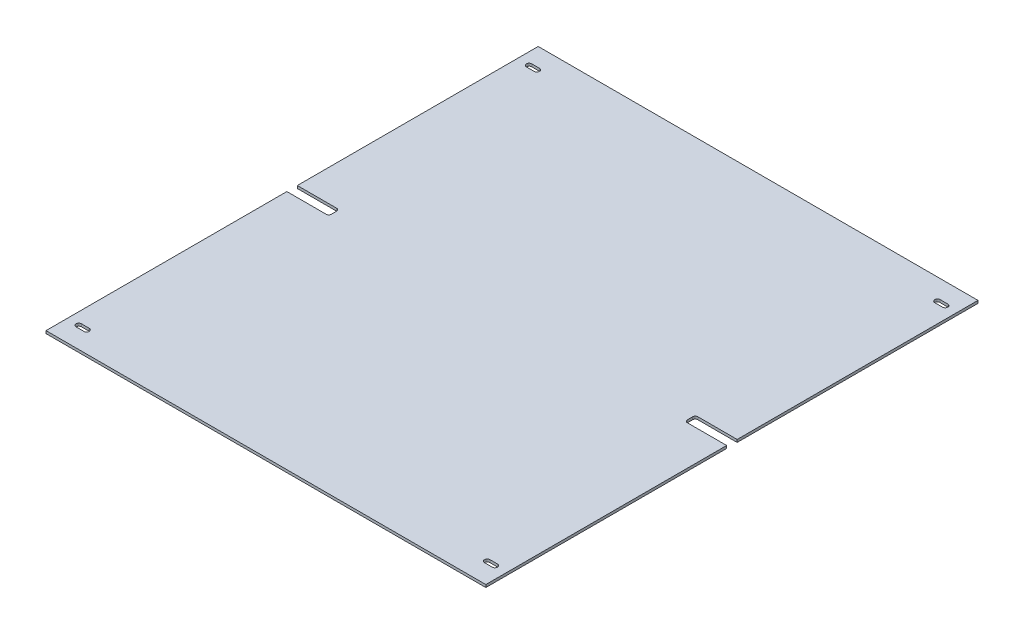
ISO-10303-21;
HEADER;
FILE_DESCRIPTION(('STEP AP214'),'2;1');
FILE_NAME('part.step','',(''),(''),'','','');
FILE_SCHEMA(('AUTOMOTIVE_DESIGN { 1 0 10303 214 1 1 1 1 }'));
ENDSEC;
DATA;
#1=APPLICATION_CONTEXT('core data for automotive mechanical design processes');
#2=APPLICATION_PROTOCOL_DEFINITION('international standard','automotive_design',2000,#1);
#3=PRODUCT_CONTEXT('',#1,'mechanical');
#4=PRODUCT('Part','Part','',(#3));
#5=PRODUCT_RELATED_PRODUCT_CATEGORY('part','',(#4));
#6=PRODUCT_DEFINITION_FORMATION('','',#4);
#7=PRODUCT_DEFINITION_CONTEXT('part definition',#1,'design');
#8=PRODUCT_DEFINITION('design','',#6,#7);
#9=PRODUCT_DEFINITION_SHAPE('','',#8);
#10=(LENGTH_UNIT() NAMED_UNIT(*) SI_UNIT(.MILLI.,.METRE.));
#11=(NAMED_UNIT(*) PLANE_ANGLE_UNIT() SI_UNIT($,.RADIAN.));
#12=(NAMED_UNIT(*) SI_UNIT($,.STERADIAN.) SOLID_ANGLE_UNIT());
#13=UNCERTAINTY_MEASURE_WITH_UNIT(LENGTH_MEASURE(1.E-05),#10,'distance_accuracy_value','');
#14=(GEOMETRIC_REPRESENTATION_CONTEXT(3) GLOBAL_UNCERTAINTY_ASSIGNED_CONTEXT((#13)) GLOBAL_UNIT_ASSIGNED_CONTEXT((#10,
#11,#12)) REPRESENTATION_CONTEXT('',''));
#15=CARTESIAN_POINT('',(0.,0.,0.));
#16=DIRECTION('',(0.,0.,1.));
#17=DIRECTION('',(1.,0.,0.));
#18=AXIS2_PLACEMENT_3D('',#15,#16,#17);
#19=CARTESIAN_POINT('',(266.7,3.175,298.45));
#20=DIRECTION('',(-1.,0.,0.));
#21=DIRECTION('',(0.,0.,1.));
#22=AXIS2_PLACEMENT_3D('',#19,#20,#21);
#23=PLANE('',#22);
#24=DIRECTION('',(0.,0.,-1.));
#25=VECTOR('',#24,1.);
#26=CARTESIAN_POINT('',(266.7,0.,298.45));
#27=LINE('',#26,#25);
#28=CARTESIAN_POINT('',(266.7,0.,298.45));
#29=VERTEX_POINT('',#28);
#30=CARTESIAN_POINT('',(266.7,0.,6.34999999999997));
#31=VERTEX_POINT('',#30);
#32=EDGE_CURVE('E772',#29,#31,#27,.T.);
#33=ORIENTED_EDGE('',*,*,#32,.T.);
#34=DIRECTION('',(0.,1.,0.));
#35=VECTOR('',#34,1.);
#36=CARTESIAN_POINT('',(266.7,0.,6.34999999999997));
#37=LINE('',#36,#35);
#38=CARTESIAN_POINT('',(266.7,3.175,6.34999999999997));
#39=VERTEX_POINT('',#38);
#40=EDGE_CURVE('E583',#31,#39,#37,.T.);
#41=ORIENTED_EDGE('',*,*,#40,.T.);
#42=DIRECTION('',(0.,0.,-1.));
#43=VECTOR('',#42,1.);
#44=CARTESIAN_POINT('',(266.7,3.175,298.45));
#45=LINE('',#44,#43);
#46=CARTESIAN_POINT('',(266.7,3.175,298.45));
#47=VERTEX_POINT('',#46);
#48=EDGE_CURVE('E759',#47,#39,#45,.T.);
#49=ORIENTED_EDGE('',*,*,#48,.F.);
#50=DIRECTION('',(0.,-1.,0.));
#51=VECTOR('',#50,1.);
#52=CARTESIAN_POINT('',(266.7,3.175,298.45));
#53=LINE('',#52,#51);
#54=EDGE_CURVE('E771',#47,#29,#53,.T.);
#55=ORIENTED_EDGE('',*,*,#54,.T.);
#56=EDGE_LOOP('',(#33,#41,#49,#55));
#57=FACE_BOUND('',#56,.T.);
#58=ADVANCED_FACE('F331',(#57),#23,.F.);
#59=CARTESIAN_POINT('',(-266.7,3.175,298.45));
#60=DIRECTION('',(1.,0.,0.));
#61=DIRECTION('',(0.,0.,-1.));
#62=AXIS2_PLACEMENT_3D('',#59,#60,#61);
#63=PLANE('',#62);
#64=DIRECTION('',(0.,0.,1.));
#65=VECTOR('',#64,1.);
#66=CARTESIAN_POINT('',(-266.7,0.,298.45));
#67=LINE('',#66,#65);
#68=CARTESIAN_POINT('',(-266.7,0.,-298.45));
#69=VERTEX_POINT('',#68);
#70=CARTESIAN_POINT('',(-266.7,0.,-6.34999999999999));
#71=VERTEX_POINT('',#70);
#72=EDGE_CURVE('E778',#69,#71,#67,.T.);
#73=ORIENTED_EDGE('',*,*,#72,.T.);
#74=DIRECTION('',(0.,1.,0.));
#75=VECTOR('',#74,1.);
#76=CARTESIAN_POINT('',(-266.7,0.,-6.34999999999999));
#77=LINE('',#76,#75);
#78=CARTESIAN_POINT('',(-266.7,3.175,-6.34999999999999));
#79=VERTEX_POINT('',#78);
#80=EDGE_CURVE('E607',#71,#79,#77,.T.);
#81=ORIENTED_EDGE('',*,*,#80,.T.);
#82=DIRECTION('',(0.,0.,1.));
#83=VECTOR('',#82,1.);
#84=CARTESIAN_POINT('',(-266.7,3.175,298.45));
#85=LINE('',#84,#83);
#86=CARTESIAN_POINT('',(-266.7,3.175,-298.45));
#87=VERTEX_POINT('',#86);
#88=EDGE_CURVE('E766',#87,#79,#85,.T.);
#89=ORIENTED_EDGE('',*,*,#88,.F.);
#90=DIRECTION('',(0.,-1.,0.));
#91=VECTOR('',#90,1.);
#92=CARTESIAN_POINT('',(-266.7,3.175,-298.45));
#93=LINE('',#92,#91);
#94=EDGE_CURVE('E339',#87,#69,#93,.T.);
#95=ORIENTED_EDGE('',*,*,#94,.T.);
#96=EDGE_LOOP('',(#73,#81,#89,#95));
#97=FACE_BOUND('',#96,.T.);
#98=ADVANCED_FACE('F792',(#97),#63,.F.);
#99=CARTESIAN_POINT('',(0.,3.175,0.));
#100=DIRECTION('',(0.,-1.,0.));
#101=DIRECTION('',(0.,0.,-1.));
#102=AXIS2_PLACEMENT_3D('',#99,#100,#101);
#103=PLANE('',#102);
#104=ORIENTED_EDGE('',*,*,#48,.T.);
#105=DIRECTION('',(1.,0.,0.));
#106=VECTOR('',#105,1.);
#107=CARTESIAN_POINT('',(219.075,3.175,6.34999999999994));
#108=LINE('',#107,#106);
#109=CARTESIAN_POINT('',(219.075,3.175,6.34999999999994));
#110=VERTEX_POINT('',#109);
#111=EDGE_CURVE('E563',#110,#39,#108,.T.);
#112=ORIENTED_EDGE('',*,*,#111,.F.);
#113=CARTESIAN_POINT('',(219.075,3.175,3.17499999999994));
#114=DIRECTION('',(0.,1.,0.));
#115=DIRECTION('',(0.,0.,1.));
#116=AXIS2_PLACEMENT_3D('',#113,#114,#115);
#117=CIRCLE('',#116,3.17500000000001);
#118=CARTESIAN_POINT('',(215.9,3.175,3.17499999999994));
#119=VERTEX_POINT('',#118);
#120=EDGE_CURVE('E565',#119,#110,#117,.T.);
#121=ORIENTED_EDGE('',*,*,#120,.F.);
#122=DIRECTION('',(0.,0.,1.));
#123=VECTOR('',#122,1.);
#124=CARTESIAN_POINT('',(215.9,3.175,-3.17500000000006));
#125=LINE('',#124,#123);
#126=CARTESIAN_POINT('',(215.9,3.175,-3.17500000000006));
#127=VERTEX_POINT('',#126);
#128=EDGE_CURVE('E578',#127,#119,#125,.T.);
#129=ORIENTED_EDGE('',*,*,#128,.F.);
#130=CARTESIAN_POINT('',(219.075,3.175,-3.17500000000006));
#131=DIRECTION('',(0.,1.,0.));
#132=DIRECTION('',(0.,0.,1.));
#133=AXIS2_PLACEMENT_3D('',#130,#131,#132);
#134=CIRCLE('',#133,3.17500000000001);
#135=CARTESIAN_POINT('',(219.075,3.175,-6.35000000000006));
#136=VERTEX_POINT('',#135);
#137=EDGE_CURVE('E575',#136,#127,#134,.T.);
#138=ORIENTED_EDGE('',*,*,#137,.F.);
#139=DIRECTION('',(-1.,0.,0.));
#140=VECTOR('',#139,1.);
#141=CARTESIAN_POINT('',(219.075,3.175,-6.35000000000006));
#142=LINE('',#141,#140);
#143=CARTESIAN_POINT('',(266.7,3.175,-6.35000000000005));
#144=VERTEX_POINT('',#143);
#145=EDGE_CURVE('E542',#144,#136,#142,.T.);
#146=ORIENTED_EDGE('',*,*,#145,.F.);
#147=CARTESIAN_POINT('',(266.7,3.175,-298.45));
#148=VERTEX_POINT('',#147);
#149=EDGE_CURVE('E763',#144,#148,#45,.T.);
#150=ORIENTED_EDGE('',*,*,#149,.T.);
#151=DIRECTION('',(-1.,0.,0.));
#152=VECTOR('',#151,1.);
#153=CARTESIAN_POINT('',(-266.7,3.175,-298.45));
#154=LINE('',#153,#152);
#155=EDGE_CURVE('E762',#148,#87,#154,.T.);
#156=ORIENTED_EDGE('',*,*,#155,.T.);
#157=ORIENTED_EDGE('',*,*,#88,.T.);
#158=DIRECTION('',(-1.,0.,0.));
#159=VECTOR('',#158,1.);
#160=CARTESIAN_POINT('',(-219.075,3.175,-6.35));
#161=LINE('',#160,#159);
#162=CARTESIAN_POINT('',(-219.075,3.175,-6.35000000000001));
#163=VERTEX_POINT('',#162);
#164=EDGE_CURVE('E608',#163,#79,#161,.T.);
#165=ORIENTED_EDGE('',*,*,#164,.F.);
#166=CARTESIAN_POINT('',(-219.075,3.175,-3.175));
#167=DIRECTION('',(0.,1.,0.));
#168=DIRECTION('',(0.,0.,-1.));
#169=AXIS2_PLACEMENT_3D('',#166,#167,#168);
#170=CIRCLE('',#169,3.17500000000001);
#171=CARTESIAN_POINT('',(-215.9,3.175,-3.175));
#172=VERTEX_POINT('',#171);
#173=EDGE_CURVE('E596',#172,#163,#170,.T.);
#174=ORIENTED_EDGE('',*,*,#173,.F.);
#175=DIRECTION('',(0.,0.,-1.));
#176=VECTOR('',#175,1.);
#177=CARTESIAN_POINT('',(-215.9,3.175,-3.175));
#178=LINE('',#177,#176);
#179=CARTESIAN_POINT('',(-215.9,3.175,3.175));
#180=VERTEX_POINT('',#179);
#181=EDGE_CURVE('E616',#180,#172,#178,.T.);
#182=ORIENTED_EDGE('',*,*,#181,.F.);
#183=CARTESIAN_POINT('',(-219.075,3.175,3.175));
#184=DIRECTION('',(0.,1.,0.));
#185=DIRECTION('',(0.,0.,-1.));
#186=AXIS2_PLACEMENT_3D('',#183,#184,#185);
#187=CIRCLE('',#186,3.17500000000001);
#188=CARTESIAN_POINT('',(-219.075,3.175,6.35));
#189=VERTEX_POINT('',#188);
#190=EDGE_CURVE('E613',#189,#180,#187,.T.);
#191=ORIENTED_EDGE('',*,*,#190,.F.);
#192=DIRECTION('',(1.,0.,0.));
#193=VECTOR('',#192,1.);
#194=CARTESIAN_POINT('',(-219.075,3.175,6.35));
#195=LINE('',#194,#193);
#196=CARTESIAN_POINT('',(-266.7,3.175,6.35000000000003));
#197=VERTEX_POINT('',#196);
#198=EDGE_CURVE('E610',#197,#189,#195,.T.);
#199=ORIENTED_EDGE('',*,*,#198,.F.);
#200=CARTESIAN_POINT('',(-266.7,3.175,298.45));
#201=VERTEX_POINT('',#200);
#202=EDGE_CURVE('E765',#197,#201,#85,.T.);
#203=ORIENTED_EDGE('',*,*,#202,.T.);
#204=DIRECTION('',(1.,0.,0.));
#205=VECTOR('',#204,1.);
#206=CARTESIAN_POINT('',(-266.7,3.175,298.45));
#207=LINE('',#206,#205);
#208=EDGE_CURVE('E769',#201,#47,#207,.T.);
#209=ORIENTED_EDGE('',*,*,#208,.T.);
#210=EDGE_LOOP('',(#104,#112,#121,#129,#138,#146,#150,#156,#157,#165,#174,#182,#191,#199,#203,#209));
#211=FACE_BOUND('',#210,.T.);
#212=CARTESIAN_POINT('',(252.3236,3.175,273.05));
#213=DIRECTION('',(0.,1.,0.));
#214=DIRECTION('',(0.,0.,1.));
#215=AXIS2_PLACEMENT_3D('',#212,#213,#214);
#216=CIRCLE('',#215,3.26389999999999);
#217=CARTESIAN_POINT('',(252.3236,3.175,276.3139));
#218=VERTEX_POINT('',#217);
#219=CARTESIAN_POINT('',(252.3236,3.175,269.7861));
#220=VERTEX_POINT('',#219);
#221=EDGE_CURVE('E748',#218,#220,#216,.T.);
#222=ORIENTED_EDGE('',*,*,#221,.F.);
#223=DIRECTION('',(1.,0.,0.));
#224=VECTOR('',#223,1.);
#225=CARTESIAN_POINT('',(242.9764,3.175,276.3139));
#226=LINE('',#225,#224);
#227=CARTESIAN_POINT('',(242.9764,3.175,276.3139));
#228=VERTEX_POINT('',#227);
#229=EDGE_CURVE('E727',#228,#218,#226,.T.);
#230=ORIENTED_EDGE('',*,*,#229,.F.);
#231=CARTESIAN_POINT('',(242.9764,3.175,273.05));
#232=DIRECTION('',(0.,1.,0.));
#233=DIRECTION('',(0.,0.,1.));
#234=AXIS2_PLACEMENT_3D('',#231,#232,#233);
#235=CIRCLE('',#234,3.26389999999999);
#236=CARTESIAN_POINT('',(242.9764,3.175,269.7861));
#237=VERTEX_POINT('',#236);
#238=EDGE_CURVE('E737',#237,#228,#235,.T.);
#239=ORIENTED_EDGE('',*,*,#238,.F.);
#240=DIRECTION('',(1.,0.,0.));
#241=VECTOR('',#240,1.);
#242=CARTESIAN_POINT('',(242.9764,3.175,269.7861));
#243=LINE('',#242,#241);
#244=EDGE_CURVE('E734',#237,#220,#243,.T.);
#245=ORIENTED_EDGE('',*,*,#244,.T.);
#246=EDGE_LOOP('',(#222,#230,#239,#245));
#247=FACE_BOUND('',#246,.T.);
#248=DIRECTION('',(1.,0.,0.));
#249=VECTOR('',#248,1.);
#250=CARTESIAN_POINT('',(242.9764,3.175,-276.3139));
#251=LINE('',#250,#249);
#252=CARTESIAN_POINT('',(242.9764,3.175,-276.3139));
#253=VERTEX_POINT('',#252);
#254=CARTESIAN_POINT('',(252.3236,3.175,-276.3139));
#255=VERTEX_POINT('',#254);
#256=EDGE_CURVE('E702',#253,#255,#251,.T.);
#257=ORIENTED_EDGE('',*,*,#256,.T.);
#258=CARTESIAN_POINT('',(252.3236,3.175,-273.05));
#259=DIRECTION('',(0.,1.,0.));
#260=DIRECTION('',(0.,0.,1.));
#261=AXIS2_PLACEMENT_3D('',#258,#259,#260);
#262=CIRCLE('',#261,3.26390000000001);
#263=CARTESIAN_POINT('',(252.3236,3.175,-269.7861));
#264=VERTEX_POINT('',#263);
#265=EDGE_CURVE('E716',#264,#255,#262,.T.);
#266=ORIENTED_EDGE('',*,*,#265,.F.);
#267=DIRECTION('',(1.,0.,0.));
#268=VECTOR('',#267,1.);
#269=CARTESIAN_POINT('',(242.9764,3.175,-269.7861));
#270=LINE('',#269,#268);
#271=CARTESIAN_POINT('',(242.9764,3.175,-269.7861));
#272=VERTEX_POINT('',#271);
#273=EDGE_CURVE('E695',#272,#264,#270,.T.);
#274=ORIENTED_EDGE('',*,*,#273,.F.);
#275=CARTESIAN_POINT('',(242.9764,3.175,-273.05));
#276=DIRECTION('',(0.,1.,0.));
#277=DIRECTION('',(0.,0.,1.));
#278=AXIS2_PLACEMENT_3D('',#275,#276,#277);
#279=CIRCLE('',#278,3.26390000000001);
#280=EDGE_CURVE('E705',#253,#272,#279,.T.);
#281=ORIENTED_EDGE('',*,*,#280,.F.);
#282=EDGE_LOOP('',(#257,#266,#274,#281));
#283=FACE_BOUND('',#282,.T.);
#284=CARTESIAN_POINT('',(-242.9764,3.175,273.05));
#285=DIRECTION('',(0.,1.,0.));
#286=DIRECTION('',(0.,0.,1.));
#287=AXIS2_PLACEMENT_3D('',#284,#285,#286);
#288=CIRCLE('',#287,3.26389999999999);
#289=CARTESIAN_POINT('',(-242.9764,3.175,276.3139));
#290=VERTEX_POINT('',#289);
#291=CARTESIAN_POINT('',(-242.9764,3.175,269.7861));
#292=VERTEX_POINT('',#291);
#293=EDGE_CURVE('E684',#290,#292,#288,.T.);
#294=ORIENTED_EDGE('',*,*,#293,.F.);
#295=DIRECTION('',(1.,0.,0.));
#296=VECTOR('',#295,1.);
#297=CARTESIAN_POINT('',(-252.3236,3.175,276.3139));
#298=LINE('',#297,#296);
#299=CARTESIAN_POINT('',(-252.3236,3.175,276.3139));
#300=VERTEX_POINT('',#299);
#301=EDGE_CURVE('E663',#300,#290,#298,.T.);
#302=ORIENTED_EDGE('',*,*,#301,.F.);
#303=CARTESIAN_POINT('',(-252.3236,3.175,273.05));
#304=DIRECTION('',(0.,1.,0.));
#305=DIRECTION('',(0.,0.,1.));
#306=AXIS2_PLACEMENT_3D('',#303,#304,#305);
#307=CIRCLE('',#306,3.26389999999999);
#308=CARTESIAN_POINT('',(-252.3236,3.175,269.7861));
#309=VERTEX_POINT('',#308);
#310=EDGE_CURVE('E673',#309,#300,#307,.T.);
#311=ORIENTED_EDGE('',*,*,#310,.F.);
#312=DIRECTION('',(1.,0.,0.));
#313=VECTOR('',#312,1.);
#314=CARTESIAN_POINT('',(-252.3236,3.175,269.7861));
#315=LINE('',#314,#313);
#316=EDGE_CURVE('E670',#309,#292,#315,.T.);
#317=ORIENTED_EDGE('',*,*,#316,.T.);
#318=EDGE_LOOP('',(#294,#302,#311,#317));
#319=FACE_BOUND('',#318,.T.);
#320=DIRECTION('',(1.,0.,0.));
#321=VECTOR('',#320,1.);
#322=CARTESIAN_POINT('',(-252.3236,3.175,-269.7861));
#323=LINE('',#322,#321);
#324=CARTESIAN_POINT('',(-252.3236,3.175,-269.7861));
#325=VERTEX_POINT('',#324);
#326=CARTESIAN_POINT('',(-242.9764,3.175,-269.7861));
#327=VERTEX_POINT('',#326);
#328=EDGE_CURVE('E586',#325,#327,#323,.T.);
#329=ORIENTED_EDGE('',*,*,#328,.F.);
#330=CARTESIAN_POINT('',(-252.3236,3.175,-273.05));
#331=DIRECTION('',(0.,1.,0.));
#332=DIRECTION('',(0.,0.,1.));
#333=AXIS2_PLACEMENT_3D('',#330,#331,#332);
#334=CIRCLE('',#333,3.26389999999999);
#335=CARTESIAN_POINT('',(-252.3236,3.175,-276.3139));
#336=VERTEX_POINT('',#335);
#337=EDGE_CURVE('E641',#336,#325,#334,.T.);
#338=ORIENTED_EDGE('',*,*,#337,.F.);
#339=DIRECTION('',(1.,0.,0.));
#340=VECTOR('',#339,1.);
#341=CARTESIAN_POINT('',(-252.3236,3.175,-276.3139));
#342=LINE('',#341,#340);
#343=CARTESIAN_POINT('',(-242.9764,3.175,-276.3139));
#344=VERTEX_POINT('',#343);
#345=EDGE_CURVE('E638',#336,#344,#342,.T.);
#346=ORIENTED_EDGE('',*,*,#345,.T.);
#347=CARTESIAN_POINT('',(-242.9764,3.175,-273.05));
#348=DIRECTION('',(0.,1.,0.));
#349=DIRECTION('',(0.,0.,1.));
#350=AXIS2_PLACEMENT_3D('',#347,#348,#349);
#351=CIRCLE('',#350,3.26389999999999);
#352=EDGE_CURVE('E652',#327,#344,#351,.T.);
#353=ORIENTED_EDGE('',*,*,#352,.F.);
#354=EDGE_LOOP('',(#329,#338,#346,#353));
#355=FACE_BOUND('',#354,.T.);
#356=ADVANCED_FACE('F801',(#211,#247,#283,#319,#355),#103,.F.);
#357=CARTESIAN_POINT('',(0.,0.,0.));
#358=DIRECTION('',(0.,-1.,0.));
#359=DIRECTION('',(0.,0.,-1.));
#360=AXIS2_PLACEMENT_3D('',#357,#358,#359);
#361=PLANE('',#360);
#362=DIRECTION('',(1.,0.,0.));
#363=VECTOR('',#362,1.);
#364=CARTESIAN_POINT('',(219.075,0.,6.34999999999994));
#365=LINE('',#364,#363);
#366=CARTESIAN_POINT('',(219.075,0.,6.34999999999994));
#367=VERTEX_POINT('',#366);
#368=EDGE_CURVE('E572',#367,#31,#365,.T.);
#369=ORIENTED_EDGE('',*,*,#368,.T.);
#370=ORIENTED_EDGE('',*,*,#32,.F.);
#371=DIRECTION('',(1.,0.,0.));
#372=VECTOR('',#371,1.);
#373=CARTESIAN_POINT('',(-266.7,0.,298.45));
#374=LINE('',#373,#372);
#375=CARTESIAN_POINT('',(-266.7,0.,298.45));
#376=VERTEX_POINT('',#375);
#377=EDGE_CURVE('E781',#376,#29,#374,.T.);
#378=ORIENTED_EDGE('',*,*,#377,.F.);
#379=CARTESIAN_POINT('',(-266.7,0.,6.35000000000008));
#380=VERTEX_POINT('',#379);
#381=EDGE_CURVE('E777',#380,#376,#67,.T.);
#382=ORIENTED_EDGE('',*,*,#381,.F.);
#383=DIRECTION('',(1.,0.,0.));
#384=VECTOR('',#383,1.);
#385=CARTESIAN_POINT('',(-219.075,0.,6.35));
#386=LINE('',#385,#384);
#387=CARTESIAN_POINT('',(-219.075,0.,6.35));
#388=VERTEX_POINT('',#387);
#389=EDGE_CURVE('E354',#380,#388,#386,.T.);
#390=ORIENTED_EDGE('',*,*,#389,.T.);
#391=CARTESIAN_POINT('',(-219.075,0.,3.175));
#392=DIRECTION('',(0.,1.,0.));
#393=DIRECTION('',(0.,0.,-1.));
#394=AXIS2_PLACEMENT_3D('',#391,#392,#393);
#395=CIRCLE('',#394,3.17500000000001);
#396=CARTESIAN_POINT('',(-215.9,0.,3.175));
#397=VERTEX_POINT('',#396);
#398=EDGE_CURVE('E598',#388,#397,#395,.T.);
#399=ORIENTED_EDGE('',*,*,#398,.T.);
#400=DIRECTION('',(0.,0.,-1.));
#401=VECTOR('',#400,1.);
#402=CARTESIAN_POINT('',(-215.9,0.,-3.175));
#403=LINE('',#402,#401);
#404=CARTESIAN_POINT('',(-215.9,0.,-3.175));
#405=VERTEX_POINT('',#404);
#406=EDGE_CURVE('E601',#397,#405,#403,.T.);
#407=ORIENTED_EDGE('',*,*,#406,.T.);
#408=CARTESIAN_POINT('',(-219.075,0.,-3.175));
#409=DIRECTION('',(0.,1.,0.));
#410=DIRECTION('',(0.,0.,-1.));
#411=AXIS2_PLACEMENT_3D('',#408,#409,#410);
#412=CIRCLE('',#411,3.17500000000001);
#413=CARTESIAN_POINT('',(-219.075,0.,-6.35000000000001));
#414=VERTEX_POINT('',#413);
#415=EDGE_CURVE('E604',#405,#414,#412,.T.);
#416=ORIENTED_EDGE('',*,*,#415,.T.);
#417=DIRECTION('',(-1.,0.,0.));
#418=VECTOR('',#417,1.);
#419=CARTESIAN_POINT('',(-219.075,0.,-6.35));
#420=LINE('',#419,#418);
#421=EDGE_CURVE('E593',#414,#71,#420,.T.);
#422=ORIENTED_EDGE('',*,*,#421,.T.);
#423=ORIENTED_EDGE('',*,*,#72,.F.);
#424=DIRECTION('',(-1.,0.,0.));
#425=VECTOR('',#424,1.);
#426=CARTESIAN_POINT('',(-266.7,0.,-298.45));
#427=LINE('',#426,#425);
#428=CARTESIAN_POINT('',(266.7,0.,-298.45));
#429=VERTEX_POINT('',#428);
#430=EDGE_CURVE('E775',#429,#69,#427,.T.);
#431=ORIENTED_EDGE('',*,*,#430,.F.);
#432=CARTESIAN_POINT('',(266.7,0.,-6.35000000000008));
#433=VERTEX_POINT('',#432);
#434=EDGE_CURVE('E562',#433,#429,#27,.T.);
#435=ORIENTED_EDGE('',*,*,#434,.F.);
#436=DIRECTION('',(-1.,0.,0.));
#437=VECTOR('',#436,1.);
#438=CARTESIAN_POINT('',(219.075,0.,-6.35000000000006));
#439=LINE('',#438,#437);
#440=CARTESIAN_POINT('',(219.075,0.,-6.35000000000006));
#441=VERTEX_POINT('',#440);
#442=EDGE_CURVE('E346',#433,#441,#439,.T.);
#443=ORIENTED_EDGE('',*,*,#442,.T.);
#444=CARTESIAN_POINT('',(219.075,0.,-3.17500000000006));
#445=DIRECTION('',(0.,1.,0.));
#446=DIRECTION('',(0.,0.,1.));
#447=AXIS2_PLACEMENT_3D('',#444,#445,#446);
#448=CIRCLE('',#447,3.17500000000001);
#449=CARTESIAN_POINT('',(215.9,0.,-3.17500000000006));
#450=VERTEX_POINT('',#449);
#451=EDGE_CURVE('E550',#441,#450,#448,.T.);
#452=ORIENTED_EDGE('',*,*,#451,.T.);
#453=DIRECTION('',(0.,0.,1.));
#454=VECTOR('',#453,1.);
#455=CARTESIAN_POINT('',(215.9,0.,-3.17500000000006));
#456=LINE('',#455,#454);
#457=CARTESIAN_POINT('',(215.9,0.,3.17499999999994));
#458=VERTEX_POINT('',#457);
#459=EDGE_CURVE('E555',#450,#458,#456,.T.);
#460=ORIENTED_EDGE('',*,*,#459,.T.);
#461=CARTESIAN_POINT('',(219.075,0.,3.17499999999994));
#462=DIRECTION('',(0.,1.,0.));
#463=DIRECTION('',(0.,0.,1.));
#464=AXIS2_PLACEMENT_3D('',#461,#462,#463);
#465=CIRCLE('',#464,3.17500000000001);
#466=EDGE_CURVE('E569',#458,#367,#465,.T.);
#467=ORIENTED_EDGE('',*,*,#466,.T.);
#468=EDGE_LOOP('',(#369,#370,#378,#382,#390,#399,#407,#416,#422,#423,#431,#435,#443,#452,#460,#467));
#469=FACE_BOUND('',#468,.T.);
#470=CARTESIAN_POINT('',(-242.9764,0.,-273.05));
#471=DIRECTION('',(0.,1.,0.));
#472=DIRECTION('',(0.,0.,1.));
#473=AXIS2_PLACEMENT_3D('',#470,#471,#472);
#474=CIRCLE('',#473,3.26389999999999);
#475=CARTESIAN_POINT('',(-242.9764,0.,-269.7861));
#476=VERTEX_POINT('',#475);
#477=CARTESIAN_POINT('',(-242.9764,0.,-276.3139));
#478=VERTEX_POINT('',#477);
#479=EDGE_CURVE('E655',#476,#478,#474,.T.);
#480=ORIENTED_EDGE('',*,*,#479,.T.);
#481=DIRECTION('',(1.,0.,0.));
#482=VECTOR('',#481,1.);
#483=CARTESIAN_POINT('',(-252.3236,0.,-276.3139));
#484=LINE('',#483,#482);
#485=CARTESIAN_POINT('',(-252.3236,0.,-276.3139));
#486=VERTEX_POINT('',#485);
#487=EDGE_CURVE('E636',#486,#478,#484,.T.);
#488=ORIENTED_EDGE('',*,*,#487,.F.);
#489=CARTESIAN_POINT('',(-252.3236,0.,-273.05));
#490=DIRECTION('',(0.,1.,0.));
#491=DIRECTION('',(0.,0.,1.));
#492=AXIS2_PLACEMENT_3D('',#489,#490,#491);
#493=CIRCLE('',#492,3.26389999999999);
#494=CARTESIAN_POINT('',(-252.3236,0.,-269.7861));
#495=VERTEX_POINT('',#494);
#496=EDGE_CURVE('E644',#486,#495,#493,.T.);
#497=ORIENTED_EDGE('',*,*,#496,.T.);
#498=DIRECTION('',(1.,0.,0.));
#499=VECTOR('',#498,1.);
#500=CARTESIAN_POINT('',(-252.3236,0.,-269.7861));
#501=LINE('',#500,#499);
#502=EDGE_CURVE('E633',#495,#476,#501,.T.);
#503=ORIENTED_EDGE('',*,*,#502,.T.);
#504=EDGE_LOOP('',(#480,#488,#497,#503));
#505=FACE_BOUND('',#504,.T.);
#506=DIRECTION('',(1.,0.,0.));
#507=VECTOR('',#506,1.);
#508=CARTESIAN_POINT('',(242.9764,0.,-269.7861));
#509=LINE('',#508,#507);
#510=CARTESIAN_POINT('',(242.9764,0.,-269.7861));
#511=VERTEX_POINT('',#510);
#512=CARTESIAN_POINT('',(252.3236,0.,-269.7861));
#513=VERTEX_POINT('',#512);
#514=EDGE_CURVE('E697',#511,#513,#509,.T.);
#515=ORIENTED_EDGE('',*,*,#514,.T.);
#516=CARTESIAN_POINT('',(252.3236,0.,-273.05));
#517=DIRECTION('',(0.,1.,0.));
#518=DIRECTION('',(0.,0.,1.));
#519=AXIS2_PLACEMENT_3D('',#516,#517,#518);
#520=CIRCLE('',#519,3.26390000000001);
#521=CARTESIAN_POINT('',(252.3236,0.,-276.3139));
#522=VERTEX_POINT('',#521);
#523=EDGE_CURVE('E719',#513,#522,#520,.T.);
#524=ORIENTED_EDGE('',*,*,#523,.T.);
#525=DIRECTION('',(1.,0.,0.));
#526=VECTOR('',#525,1.);
#527=CARTESIAN_POINT('',(242.9764,0.,-276.3139));
#528=LINE('',#527,#526);
#529=CARTESIAN_POINT('',(242.9764,0.,-276.3139));
#530=VERTEX_POINT('',#529);
#531=EDGE_CURVE('E700',#530,#522,#528,.T.);
#532=ORIENTED_EDGE('',*,*,#531,.F.);
#533=CARTESIAN_POINT('',(242.9764,0.,-273.05));
#534=DIRECTION('',(0.,1.,0.));
#535=DIRECTION('',(0.,0.,1.));
#536=AXIS2_PLACEMENT_3D('',#533,#534,#535);
#537=CIRCLE('',#536,3.26390000000001);
#538=EDGE_CURVE('E708',#530,#511,#537,.T.);
#539=ORIENTED_EDGE('',*,*,#538,.T.);
#540=EDGE_LOOP('',(#515,#524,#532,#539));
#541=FACE_BOUND('',#540,.T.);
#542=CARTESIAN_POINT('',(252.3236,0.,273.05));
#543=DIRECTION('',(0.,1.,0.));
#544=DIRECTION('',(0.,0.,1.));
#545=AXIS2_PLACEMENT_3D('',#542,#543,#544);
#546=CIRCLE('',#545,3.26389999999999);
#547=CARTESIAN_POINT('',(252.3236,0.,276.3139));
#548=VERTEX_POINT('',#547);
#549=CARTESIAN_POINT('',(252.3236,0.,269.7861));
#550=VERTEX_POINT('',#549);
#551=EDGE_CURVE('E751',#548,#550,#546,.T.);
#552=ORIENTED_EDGE('',*,*,#551,.T.);
#553=DIRECTION('',(1.,0.,0.));
#554=VECTOR('',#553,1.);
#555=CARTESIAN_POINT('',(242.9764,0.,269.7861));
#556=LINE('',#555,#554);
#557=CARTESIAN_POINT('',(242.9764,0.,269.7861));
#558=VERTEX_POINT('',#557);
#559=EDGE_CURVE('E732',#558,#550,#556,.T.);
#560=ORIENTED_EDGE('',*,*,#559,.F.);
#561=CARTESIAN_POINT('',(242.9764,0.,273.05));
#562=DIRECTION('',(0.,1.,0.));
#563=DIRECTION('',(0.,0.,1.));
#564=AXIS2_PLACEMENT_3D('',#561,#562,#563);
#565=CIRCLE('',#564,3.26389999999999);
#566=CARTESIAN_POINT('',(242.9764,0.,276.3139));
#567=VERTEX_POINT('',#566);
#568=EDGE_CURVE('E740',#558,#567,#565,.T.);
#569=ORIENTED_EDGE('',*,*,#568,.T.);
#570=DIRECTION('',(1.,0.,0.));
#571=VECTOR('',#570,1.);
#572=CARTESIAN_POINT('',(242.9764,0.,276.3139));
#573=LINE('',#572,#571);
#574=EDGE_CURVE('E729',#567,#548,#573,.T.);
#575=ORIENTED_EDGE('',*,*,#574,.T.);
#576=EDGE_LOOP('',(#552,#560,#569,#575));
#577=FACE_BOUND('',#576,.T.);
#578=CARTESIAN_POINT('',(-252.3236,0.,273.05));
#579=DIRECTION('',(0.,1.,0.));
#580=DIRECTION('',(0.,0.,1.));
#581=AXIS2_PLACEMENT_3D('',#578,#579,#580);
#582=CIRCLE('',#581,3.26389999999999);
#583=CARTESIAN_POINT('',(-252.3236,0.,269.7861));
#584=VERTEX_POINT('',#583);
#585=CARTESIAN_POINT('',(-252.3236,0.,276.3139));
#586=VERTEX_POINT('',#585);
#587=EDGE_CURVE('E676',#584,#586,#582,.T.);
#588=ORIENTED_EDGE('',*,*,#587,.T.);
#589=DIRECTION('',(1.,0.,0.));
#590=VECTOR('',#589,1.);
#591=CARTESIAN_POINT('',(-252.3236,0.,276.3139));
#592=LINE('',#591,#590);
#593=CARTESIAN_POINT('',(-242.9764,0.,276.3139));
#594=VERTEX_POINT('',#593);
#595=EDGE_CURVE('E665',#586,#594,#592,.T.);
#596=ORIENTED_EDGE('',*,*,#595,.T.);
#597=CARTESIAN_POINT('',(-242.9764,0.,273.05));
#598=DIRECTION('',(0.,1.,0.));
#599=DIRECTION('',(0.,0.,1.));
#600=AXIS2_PLACEMENT_3D('',#597,#598,#599);
#601=CIRCLE('',#600,3.26389999999999);
#602=CARTESIAN_POINT('',(-242.9764,0.,269.7861));
#603=VERTEX_POINT('',#602);
#604=EDGE_CURVE('E687',#594,#603,#601,.T.);
#605=ORIENTED_EDGE('',*,*,#604,.T.);
#606=DIRECTION('',(1.,0.,0.));
#607=VECTOR('',#606,1.);
#608=CARTESIAN_POINT('',(-252.3236,0.,269.7861));
#609=LINE('',#608,#607);
#610=EDGE_CURVE('E668',#584,#603,#609,.T.);
#611=ORIENTED_EDGE('',*,*,#610,.F.);
#612=EDGE_LOOP('',(#588,#596,#605,#611));
#613=FACE_BOUND('',#612,.T.);
#614=ADVANCED_FACE('F559',(#469,#505,#541,#577,#613),#361,.T.);
#615=ORIENTED_EDGE('',*,*,#149,.F.);
#616=DIRECTION('',(0.,1.,0.));
#617=VECTOR('',#616,1.);
#618=CARTESIAN_POINT('',(266.7,0.,-6.35000000000005));
#619=LINE('',#618,#617);
#620=EDGE_CURVE('E547',#433,#144,#619,.T.);
#621=ORIENTED_EDGE('',*,*,#620,.F.);
#622=ORIENTED_EDGE('',*,*,#434,.T.);
#623=DIRECTION('',(0.,-1.,0.));
#624=VECTOR('',#623,1.);
#625=CARTESIAN_POINT('',(266.7,3.175,-298.45));
#626=LINE('',#625,#624);
#627=EDGE_CURVE('E13',#148,#429,#626,.T.);
#628=ORIENTED_EDGE('',*,*,#627,.F.);
#629=EDGE_LOOP('',(#615,#621,#622,#628));
#630=FACE_BOUND('',#629,.T.);
#631=ADVANCED_FACE('F333',(#630),#23,.F.);
#632=CARTESIAN_POINT('',(-266.7,3.175,-298.45));
#633=DIRECTION('',(0.,0.,1.));
#634=DIRECTION('',(1.,0.,0.));
#635=AXIS2_PLACEMENT_3D('',#632,#633,#634);
#636=PLANE('',#635);
#637=ORIENTED_EDGE('',*,*,#430,.T.);
#638=ORIENTED_EDGE('',*,*,#94,.F.);
#639=ORIENTED_EDGE('',*,*,#155,.F.);
#640=ORIENTED_EDGE('',*,*,#627,.T.);
#641=EDGE_LOOP('',(#637,#638,#639,#640));
#642=FACE_BOUND('',#641,.T.);
#643=ADVANCED_FACE('F806',(#642),#636,.F.);
#644=ORIENTED_EDGE('',*,*,#202,.F.);
#645=DIRECTION('',(0.,1.,0.));
#646=VECTOR('',#645,1.);
#647=CARTESIAN_POINT('',(-266.7,0.,6.35000000000003));
#648=LINE('',#647,#646);
#649=EDGE_CURVE('E628',#380,#197,#648,.T.);
#650=ORIENTED_EDGE('',*,*,#649,.F.);
#651=ORIENTED_EDGE('',*,*,#381,.T.);
#652=DIRECTION('',(0.,-1.,0.));
#653=VECTOR('',#652,1.);
#654=CARTESIAN_POINT('',(-266.7,3.175,298.45));
#655=LINE('',#654,#653);
#656=EDGE_CURVE('E785',#201,#376,#655,.T.);
#657=ORIENTED_EDGE('',*,*,#656,.F.);
#658=EDGE_LOOP('',(#644,#650,#651,#657));
#659=FACE_BOUND('',#658,.T.);
#660=ADVANCED_FACE('F832',(#659),#63,.F.);
#661=CARTESIAN_POINT('',(-266.7,3.175,298.45));
#662=DIRECTION('',(0.,0.,-1.));
#663=DIRECTION('',(-1.,0.,0.));
#664=AXIS2_PLACEMENT_3D('',#661,#662,#663);
#665=PLANE('',#664);
#666=ORIENTED_EDGE('',*,*,#377,.T.);
#667=ORIENTED_EDGE('',*,*,#54,.F.);
#668=ORIENTED_EDGE('',*,*,#208,.F.);
#669=ORIENTED_EDGE('',*,*,#656,.T.);
#670=EDGE_LOOP('',(#666,#667,#668,#669));
#671=FACE_BOUND('',#670,.T.);
#672=ADVANCED_FACE('F828',(#671),#665,.F.);
#673=CARTESIAN_POINT('',(252.3236,3.175,273.05));
#674=DIRECTION('',(0.,1.,0.));
#675=DIRECTION('',(0.,0.,1.));
#676=AXIS2_PLACEMENT_3D('',#673,#674,#675);
#677=CYLINDRICAL_SURFACE('',#676,3.26389999999999);
#678=ORIENTED_EDGE('',*,*,#551,.F.);
#679=DIRECTION('',(0.,1.,0.));
#680=VECTOR('',#679,1.);
#681=CARTESIAN_POINT('',(252.3236,3.175,276.3139));
#682=LINE('',#681,#680);
#683=EDGE_CURVE('E756',#218,#548,#682,.F.);
#684=ORIENTED_EDGE('',*,*,#683,.F.);
#685=ORIENTED_EDGE('',*,*,#221,.T.);
#686=DIRECTION('',(0.,1.,0.));
#687=VECTOR('',#686,1.);
#688=CARTESIAN_POINT('',(252.3236,3.175,269.7861));
#689=LINE('',#688,#687);
#690=EDGE_CURVE('E754',#550,#220,#689,.T.);
#691=ORIENTED_EDGE('',*,*,#690,.F.);
#692=EDGE_LOOP('',(#678,#684,#685,#691));
#693=FACE_BOUND('',#692,.T.);
#694=ADVANCED_FACE('F872',(#693),#677,.F.);
#695=CARTESIAN_POINT('',(242.9764,3.175,273.05));
#696=DIRECTION('',(0.,1.,0.));
#697=DIRECTION('',(0.,0.,1.));
#698=AXIS2_PLACEMENT_3D('',#695,#696,#697);
#699=CYLINDRICAL_SURFACE('',#698,3.26389999999999);
#700=ORIENTED_EDGE('',*,*,#238,.T.);
#701=DIRECTION('',(0.,1.,0.));
#702=VECTOR('',#701,1.);
#703=CARTESIAN_POINT('',(242.9764,3.175,276.3139));
#704=LINE('',#703,#702);
#705=EDGE_CURVE('E743',#567,#228,#704,.T.);
#706=ORIENTED_EDGE('',*,*,#705,.F.);
#707=ORIENTED_EDGE('',*,*,#568,.F.);
#708=DIRECTION('',(0.,1.,0.));
#709=VECTOR('',#708,1.);
#710=CARTESIAN_POINT('',(242.9764,3.175,269.7861));
#711=LINE('',#710,#709);
#712=EDGE_CURVE('E745',#237,#558,#711,.F.);
#713=ORIENTED_EDGE('',*,*,#712,.F.);
#714=EDGE_LOOP('',(#700,#706,#707,#713));
#715=FACE_BOUND('',#714,.T.);
#716=ADVANCED_FACE('F889',(#715),#699,.F.);
#717=CARTESIAN_POINT('',(242.9764,3.175,269.7861));
#718=DIRECTION('',(0.,0.,-1.));
#719=DIRECTION('',(-1.,0.,0.));
#720=AXIS2_PLACEMENT_3D('',#717,#718,#719);
#721=PLANE('',#720);
#722=ORIENTED_EDGE('',*,*,#690,.T.);
#723=ORIENTED_EDGE('',*,*,#244,.F.);
#724=ORIENTED_EDGE('',*,*,#712,.T.);
#725=ORIENTED_EDGE('',*,*,#559,.T.);
#726=EDGE_LOOP('',(#722,#723,#724,#725));
#727=FACE_BOUND('',#726,.T.);
#728=ADVANCED_FACE('F896',(#727),#721,.F.);
#729=CARTESIAN_POINT('',(242.9764,3.175,276.3139));
#730=DIRECTION('',(0.,0.,1.));
#731=DIRECTION('',(1.,0.,0.));
#732=AXIS2_PLACEMENT_3D('',#729,#730,#731);
#733=PLANE('',#732);
#734=ORIENTED_EDGE('',*,*,#683,.T.);
#735=ORIENTED_EDGE('',*,*,#574,.F.);
#736=ORIENTED_EDGE('',*,*,#705,.T.);
#737=ORIENTED_EDGE('',*,*,#229,.T.);
#738=EDGE_LOOP('',(#734,#735,#736,#737));
#739=FACE_BOUND('',#738,.T.);
#740=ADVANCED_FACE('F904',(#739),#733,.F.);
#741=CARTESIAN_POINT('',(252.3236,3.175,-273.05));
#742=DIRECTION('',(0.,1.,0.));
#743=DIRECTION('',(0.,0.,1.));
#744=AXIS2_PLACEMENT_3D('',#741,#742,#743);
#745=CYLINDRICAL_SURFACE('',#744,3.26390000000001);
#746=ORIENTED_EDGE('',*,*,#523,.F.);
#747=DIRECTION('',(0.,1.,0.));
#748=VECTOR('',#747,1.);
#749=CARTESIAN_POINT('',(252.3236,3.175,-269.7861));
#750=LINE('',#749,#748);
#751=EDGE_CURVE('E724',#264,#513,#750,.F.);
#752=ORIENTED_EDGE('',*,*,#751,.F.);
#753=ORIENTED_EDGE('',*,*,#265,.T.);
#754=DIRECTION('',(0.,1.,0.));
#755=VECTOR('',#754,1.);
#756=CARTESIAN_POINT('',(252.3236,3.175,-276.3139));
#757=LINE('',#756,#755);
#758=EDGE_CURVE('E722',#522,#255,#757,.T.);
#759=ORIENTED_EDGE('',*,*,#758,.F.);
#760=EDGE_LOOP('',(#746,#752,#753,#759));
#761=FACE_BOUND('',#760,.T.);
#762=ADVANCED_FACE('F912',(#761),#745,.F.);
#763=CARTESIAN_POINT('',(242.9764,3.175,-273.05));
#764=DIRECTION('',(0.,1.,0.));
#765=DIRECTION('',(0.,0.,1.));
#766=AXIS2_PLACEMENT_3D('',#763,#764,#765);
#767=CYLINDRICAL_SURFACE('',#766,3.26390000000001);
#768=ORIENTED_EDGE('',*,*,#280,.T.);
#769=DIRECTION('',(0.,1.,0.));
#770=VECTOR('',#769,1.);
#771=CARTESIAN_POINT('',(242.9764,3.175,-269.7861));
#772=LINE('',#771,#770);
#773=EDGE_CURVE('E711',#511,#272,#772,.T.);
#774=ORIENTED_EDGE('',*,*,#773,.F.);
#775=ORIENTED_EDGE('',*,*,#538,.F.);
#776=DIRECTION('',(0.,1.,0.));
#777=VECTOR('',#776,1.);
#778=CARTESIAN_POINT('',(242.9764,3.175,-276.3139));
#779=LINE('',#778,#777);
#780=EDGE_CURVE('E713',#253,#530,#779,.F.);
#781=ORIENTED_EDGE('',*,*,#780,.F.);
#782=EDGE_LOOP('',(#768,#774,#775,#781));
#783=FACE_BOUND('',#782,.T.);
#784=ADVANCED_FACE('F920',(#783),#767,.F.);
#785=CARTESIAN_POINT('',(242.9764,3.175,-276.3139));
#786=DIRECTION('',(0.,0.,-1.));
#787=DIRECTION('',(-1.,0.,0.));
#788=AXIS2_PLACEMENT_3D('',#785,#786,#787);
#789=PLANE('',#788);
#790=ORIENTED_EDGE('',*,*,#758,.T.);
#791=ORIENTED_EDGE('',*,*,#256,.F.);
#792=ORIENTED_EDGE('',*,*,#780,.T.);
#793=ORIENTED_EDGE('',*,*,#531,.T.);
#794=EDGE_LOOP('',(#790,#791,#792,#793));
#795=FACE_BOUND('',#794,.T.);
#796=ADVANCED_FACE('F928',(#795),#789,.F.);
#797=CARTESIAN_POINT('',(242.9764,3.175,-269.7861));
#798=DIRECTION('',(0.,0.,1.));
#799=DIRECTION('',(1.,0.,0.));
#800=AXIS2_PLACEMENT_3D('',#797,#798,#799);
#801=PLANE('',#800);
#802=ORIENTED_EDGE('',*,*,#751,.T.);
#803=ORIENTED_EDGE('',*,*,#514,.F.);
#804=ORIENTED_EDGE('',*,*,#773,.T.);
#805=ORIENTED_EDGE('',*,*,#273,.T.);
#806=EDGE_LOOP('',(#802,#803,#804,#805));
#807=FACE_BOUND('',#806,.T.);
#808=ADVANCED_FACE('F936',(#807),#801,.F.);
#809=CARTESIAN_POINT('',(-242.9764,3.175,273.05));
#810=DIRECTION('',(0.,1.,0.));
#811=DIRECTION('',(0.,0.,1.));
#812=AXIS2_PLACEMENT_3D('',#809,#810,#811);
#813=CYLINDRICAL_SURFACE('',#812,3.26389999999999);
#814=ORIENTED_EDGE('',*,*,#604,.F.);
#815=DIRECTION('',(0.,1.,0.));
#816=VECTOR('',#815,1.);
#817=CARTESIAN_POINT('',(-242.9764,3.175,276.3139));
#818=LINE('',#817,#816);
#819=EDGE_CURVE('E692',#290,#594,#818,.F.);
#820=ORIENTED_EDGE('',*,*,#819,.F.);
#821=ORIENTED_EDGE('',*,*,#293,.T.);
#822=DIRECTION('',(0.,1.,0.));
#823=VECTOR('',#822,1.);
#824=CARTESIAN_POINT('',(-242.9764,3.175,269.7861));
#825=LINE('',#824,#823);
#826=EDGE_CURVE('E690',#603,#292,#825,.T.);
#827=ORIENTED_EDGE('',*,*,#826,.F.);
#828=EDGE_LOOP('',(#814,#820,#821,#827));
#829=FACE_BOUND('',#828,.T.);
#830=ADVANCED_FACE('F944',(#829),#813,.F.);
#831=CARTESIAN_POINT('',(-252.3236,3.175,273.05));
#832=DIRECTION('',(0.,1.,0.));
#833=DIRECTION('',(0.,0.,1.));
#834=AXIS2_PLACEMENT_3D('',#831,#832,#833);
#835=CYLINDRICAL_SURFACE('',#834,3.26389999999999);
#836=ORIENTED_EDGE('',*,*,#310,.T.);
#837=DIRECTION('',(0.,1.,0.));
#838=VECTOR('',#837,1.);
#839=CARTESIAN_POINT('',(-252.3236,3.175,276.3139));
#840=LINE('',#839,#838);
#841=EDGE_CURVE('E679',#586,#300,#840,.T.);
#842=ORIENTED_EDGE('',*,*,#841,.F.);
#843=ORIENTED_EDGE('',*,*,#587,.F.);
#844=DIRECTION('',(0.,1.,0.));
#845=VECTOR('',#844,1.);
#846=CARTESIAN_POINT('',(-252.3236,3.175,269.7861));
#847=LINE('',#846,#845);
#848=EDGE_CURVE('E681',#309,#584,#847,.F.);
#849=ORIENTED_EDGE('',*,*,#848,.F.);
#850=EDGE_LOOP('',(#836,#842,#843,#849));
#851=FACE_BOUND('',#850,.T.);
#852=ADVANCED_FACE('F952',(#851),#835,.F.);
#853=CARTESIAN_POINT('',(-252.3236,3.175,269.7861));
#854=DIRECTION('',(0.,0.,-1.));
#855=DIRECTION('',(-1.,0.,0.));
#856=AXIS2_PLACEMENT_3D('',#853,#854,#855);
#857=PLANE('',#856);
#858=ORIENTED_EDGE('',*,*,#826,.T.);
#859=ORIENTED_EDGE('',*,*,#316,.F.);
#860=ORIENTED_EDGE('',*,*,#848,.T.);
#861=ORIENTED_EDGE('',*,*,#610,.T.);
#862=EDGE_LOOP('',(#858,#859,#860,#861));
#863=FACE_BOUND('',#862,.T.);
#864=ADVANCED_FACE('F960',(#863),#857,.F.);
#865=CARTESIAN_POINT('',(-252.3236,3.175,276.3139));
#866=DIRECTION('',(0.,0.,1.));
#867=DIRECTION('',(1.,0.,0.));
#868=AXIS2_PLACEMENT_3D('',#865,#866,#867);
#869=PLANE('',#868);
#870=ORIENTED_EDGE('',*,*,#819,.T.);
#871=ORIENTED_EDGE('',*,*,#595,.F.);
#872=ORIENTED_EDGE('',*,*,#841,.T.);
#873=ORIENTED_EDGE('',*,*,#301,.T.);
#874=EDGE_LOOP('',(#870,#871,#872,#873));
#875=FACE_BOUND('',#874,.T.);
#876=ADVANCED_FACE('F968',(#875),#869,.F.);
#877=CARTESIAN_POINT('',(-242.9764,3.175,-273.05));
#878=DIRECTION('',(0.,1.,0.));
#879=DIRECTION('',(0.,0.,1.));
#880=AXIS2_PLACEMENT_3D('',#877,#878,#879);
#881=CYLINDRICAL_SURFACE('',#880,3.26389999999999);
#882=ORIENTED_EDGE('',*,*,#479,.F.);
#883=DIRECTION('',(0.,1.,0.));
#884=VECTOR('',#883,1.);
#885=CARTESIAN_POINT('',(-242.9764,3.175,-269.7861));
#886=LINE('',#885,#884);
#887=EDGE_CURVE('E660',#327,#476,#886,.F.);
#888=ORIENTED_EDGE('',*,*,#887,.F.);
#889=ORIENTED_EDGE('',*,*,#352,.T.);
#890=DIRECTION('',(0.,1.,0.));
#891=VECTOR('',#890,1.);
#892=CARTESIAN_POINT('',(-242.9764,3.175,-276.3139));
#893=LINE('',#892,#891);
#894=EDGE_CURVE('E658',#478,#344,#893,.T.);
#895=ORIENTED_EDGE('',*,*,#894,.F.);
#896=EDGE_LOOP('',(#882,#888,#889,#895));
#897=FACE_BOUND('',#896,.T.);
#898=ADVANCED_FACE('F976',(#897),#881,.F.);
#899=CARTESIAN_POINT('',(-252.3236,3.175,-273.05));
#900=DIRECTION('',(0.,1.,0.));
#901=DIRECTION('',(0.,0.,1.));
#902=AXIS2_PLACEMENT_3D('',#899,#900,#901);
#903=CYLINDRICAL_SURFACE('',#902,3.26389999999999);
#904=ORIENTED_EDGE('',*,*,#337,.T.);
#905=DIRECTION('',(0.,1.,0.));
#906=VECTOR('',#905,1.);
#907=CARTESIAN_POINT('',(-252.3236,3.175,-269.7861));
#908=LINE('',#907,#906);
#909=EDGE_CURVE('E647',#495,#325,#908,.T.);
#910=ORIENTED_EDGE('',*,*,#909,.F.);
#911=ORIENTED_EDGE('',*,*,#496,.F.);
#912=DIRECTION('',(0.,1.,0.));
#913=VECTOR('',#912,1.);
#914=CARTESIAN_POINT('',(-252.3236,3.175,-276.3139));
#915=LINE('',#914,#913);
#916=EDGE_CURVE('E649',#336,#486,#915,.F.);
#917=ORIENTED_EDGE('',*,*,#916,.F.);
#918=EDGE_LOOP('',(#904,#910,#911,#917));
#919=FACE_BOUND('',#918,.T.);
#920=ADVANCED_FACE('F984',(#919),#903,.F.);
#921=CARTESIAN_POINT('',(-252.3236,3.175,-276.3139));
#922=DIRECTION('',(0.,0.,-1.));
#923=DIRECTION('',(-1.,0.,0.));
#924=AXIS2_PLACEMENT_3D('',#921,#922,#923);
#925=PLANE('',#924);
#926=ORIENTED_EDGE('',*,*,#894,.T.);
#927=ORIENTED_EDGE('',*,*,#345,.F.);
#928=ORIENTED_EDGE('',*,*,#916,.T.);
#929=ORIENTED_EDGE('',*,*,#487,.T.);
#930=EDGE_LOOP('',(#926,#927,#928,#929));
#931=FACE_BOUND('',#930,.T.);
#932=ADVANCED_FACE('F992',(#931),#925,.F.);
#933=CARTESIAN_POINT('',(-252.3236,3.175,-269.7861));
#934=DIRECTION('',(0.,0.,1.));
#935=DIRECTION('',(1.,0.,0.));
#936=AXIS2_PLACEMENT_3D('',#933,#934,#935);
#937=PLANE('',#936);
#938=ORIENTED_EDGE('',*,*,#887,.T.);
#939=ORIENTED_EDGE('',*,*,#502,.F.);
#940=ORIENTED_EDGE('',*,*,#909,.T.);
#941=ORIENTED_EDGE('',*,*,#328,.T.);
#942=EDGE_LOOP('',(#938,#939,#940,#941));
#943=FACE_BOUND('',#942,.T.);
#944=ADVANCED_FACE('F851',(#943),#937,.F.);
#945=CARTESIAN_POINT('',(-219.075,0.,-6.35));
#946=DIRECTION('',(0.,0.,-1.));
#947=DIRECTION('',(-1.,0.,0.));
#948=AXIS2_PLACEMENT_3D('',#945,#946,#947);
#949=PLANE('',#948);
#950=ORIENTED_EDGE('',*,*,#164,.T.);
#951=ORIENTED_EDGE('',*,*,#80,.F.);
#952=ORIENTED_EDGE('',*,*,#421,.F.);
#953=DIRECTION('',(0.,1.,0.));
#954=VECTOR('',#953,1.);
#955=CARTESIAN_POINT('',(-219.075,0.,-6.35000000000001));
#956=LINE('',#955,#954);
#957=EDGE_CURVE('E576',#414,#163,#956,.T.);
#958=ORIENTED_EDGE('',*,*,#957,.T.);
#959=EDGE_LOOP('',(#950,#951,#952,#958));
#960=FACE_BOUND('',#959,.T.);
#961=ADVANCED_FACE('F798',(#960),#949,.F.);
#962=CARTESIAN_POINT('',(-219.075,0.,-3.175));
#963=DIRECTION('',(0.,1.,0.));
#964=DIRECTION('',(0.,0.,1.));
#965=AXIS2_PLACEMENT_3D('',#962,#963,#964);
#966=CYLINDRICAL_SURFACE('',#965,3.17500000000001);
#967=ORIENTED_EDGE('',*,*,#173,.T.);
#968=ORIENTED_EDGE('',*,*,#957,.F.);
#969=ORIENTED_EDGE('',*,*,#415,.F.);
#970=DIRECTION('',(0.,1.,0.));
#971=VECTOR('',#970,1.);
#972=CARTESIAN_POINT('',(-215.9,0.,-3.175));
#973=LINE('',#972,#971);
#974=EDGE_CURVE('E622',#405,#172,#973,.T.);
#975=ORIENTED_EDGE('',*,*,#974,.T.);
#976=EDGE_LOOP('',(#967,#968,#969,#975));
#977=FACE_BOUND('',#976,.T.);
#978=ADVANCED_FACE('F843',(#977),#966,.F.);
#979=CARTESIAN_POINT('',(-215.9,0.,-3.175));
#980=DIRECTION('',(1.,0.,0.));
#981=DIRECTION('',(0.,0.,-1.));
#982=AXIS2_PLACEMENT_3D('',#979,#980,#981);
#983=PLANE('',#982);
#984=ORIENTED_EDGE('',*,*,#181,.T.);
#985=ORIENTED_EDGE('',*,*,#974,.F.);
#986=ORIENTED_EDGE('',*,*,#406,.F.);
#987=DIRECTION('',(0.,1.,0.));
#988=VECTOR('',#987,1.);
#989=CARTESIAN_POINT('',(-215.9,0.,3.175));
#990=LINE('',#989,#988);
#991=EDGE_CURVE('E624',#397,#180,#990,.T.);
#992=ORIENTED_EDGE('',*,*,#991,.T.);
#993=EDGE_LOOP('',(#984,#985,#986,#992));
#994=FACE_BOUND('',#993,.T.);
#995=ADVANCED_FACE('F841',(#994),#983,.F.);
#996=CARTESIAN_POINT('',(-219.075,0.,3.175));
#997=DIRECTION('',(0.,1.,0.));
#998=DIRECTION('',(0.,0.,1.));
#999=AXIS2_PLACEMENT_3D('',#996,#997,#998);
#1000=CYLINDRICAL_SURFACE('',#999,3.17500000000001);
#1001=ORIENTED_EDGE('',*,*,#190,.T.);
#1002=ORIENTED_EDGE('',*,*,#991,.F.);
#1003=ORIENTED_EDGE('',*,*,#398,.F.);
#1004=DIRECTION('',(0.,1.,0.));
#1005=VECTOR('',#1004,1.);
#1006=CARTESIAN_POINT('',(-219.075,0.,6.35));
#1007=LINE('',#1006,#1005);
#1008=EDGE_CURVE('E626',#388,#189,#1007,.T.);
#1009=ORIENTED_EDGE('',*,*,#1008,.T.);
#1010=EDGE_LOOP('',(#1001,#1002,#1003,#1009));
#1011=FACE_BOUND('',#1010,.T.);
#1012=ADVANCED_FACE('F837',(#1011),#1000,.F.);
#1013=CARTESIAN_POINT('',(-219.075,0.,6.35));
#1014=DIRECTION('',(0.,0.,1.));
#1015=DIRECTION('',(1.,0.,0.));
#1016=AXIS2_PLACEMENT_3D('',#1013,#1014,#1015);
#1017=PLANE('',#1016);
#1018=ORIENTED_EDGE('',*,*,#198,.T.);
#1019=ORIENTED_EDGE('',*,*,#1008,.F.);
#1020=ORIENTED_EDGE('',*,*,#389,.F.);
#1021=ORIENTED_EDGE('',*,*,#649,.T.);
#1022=EDGE_LOOP('',(#1018,#1019,#1020,#1021));
#1023=FACE_BOUND('',#1022,.T.);
#1024=ADVANCED_FACE('F833',(#1023),#1017,.F.);
#1025=CARTESIAN_POINT('',(219.075,0.,6.34999999999994));
#1026=DIRECTION('',(0.,0.,1.));
#1027=DIRECTION('',(1.,0.,0.));
#1028=AXIS2_PLACEMENT_3D('',#1025,#1026,#1027);
#1029=PLANE('',#1028);
#1030=ORIENTED_EDGE('',*,*,#111,.T.);
#1031=ORIENTED_EDGE('',*,*,#40,.F.);
#1032=ORIENTED_EDGE('',*,*,#368,.F.);
#1033=DIRECTION('',(0.,1.,0.));
#1034=VECTOR('',#1033,1.);
#1035=CARTESIAN_POINT('',(219.075,0.,6.34999999999994));
#1036=LINE('',#1035,#1034);
#1037=EDGE_CURVE('E587',#367,#110,#1036,.T.);
#1038=ORIENTED_EDGE('',*,*,#1037,.T.);
#1039=EDGE_LOOP('',(#1030,#1031,#1032,#1038));
#1040=FACE_BOUND('',#1039,.T.);
#1041=ADVANCED_FACE('F819',(#1040),#1029,.F.);
#1042=CARTESIAN_POINT('',(219.075,0.,3.17499999999994));
#1043=DIRECTION('',(0.,1.,0.));
#1044=DIRECTION('',(0.,0.,1.));
#1045=AXIS2_PLACEMENT_3D('',#1042,#1043,#1044);
#1046=CYLINDRICAL_SURFACE('',#1045,3.17500000000001);
#1047=ORIENTED_EDGE('',*,*,#120,.T.);
#1048=ORIENTED_EDGE('',*,*,#1037,.F.);
#1049=ORIENTED_EDGE('',*,*,#466,.F.);
#1050=DIRECTION('',(0.,1.,0.));
#1051=VECTOR('',#1050,1.);
#1052=CARTESIAN_POINT('',(215.9,0.,3.17499999999994));
#1053=LINE('',#1052,#1051);
#1054=EDGE_CURVE('E589',#458,#119,#1053,.T.);
#1055=ORIENTED_EDGE('',*,*,#1054,.T.);
#1056=EDGE_LOOP('',(#1047,#1048,#1049,#1055));
#1057=FACE_BOUND('',#1056,.T.);
#1058=ADVANCED_FACE('F817',(#1057),#1046,.F.);
#1059=CARTESIAN_POINT('',(215.9,0.,-3.17500000000006));
#1060=DIRECTION('',(-1.,0.,0.));
#1061=DIRECTION('',(0.,0.,1.));
#1062=AXIS2_PLACEMENT_3D('',#1059,#1060,#1061);
#1063=PLANE('',#1062);
#1064=ORIENTED_EDGE('',*,*,#128,.T.);
#1065=ORIENTED_EDGE('',*,*,#1054,.F.);
#1066=ORIENTED_EDGE('',*,*,#459,.F.);
#1067=DIRECTION('',(0.,1.,0.));
#1068=VECTOR('',#1067,1.);
#1069=CARTESIAN_POINT('',(215.9,0.,-3.17500000000006));
#1070=LINE('',#1069,#1068);
#1071=EDGE_CURVE('E546',#450,#127,#1070,.T.);
#1072=ORIENTED_EDGE('',*,*,#1071,.T.);
#1073=EDGE_LOOP('',(#1064,#1065,#1066,#1072));
#1074=FACE_BOUND('',#1073,.T.);
#1075=ADVANCED_FACE('F812',(#1074),#1063,.F.);
#1076=CARTESIAN_POINT('',(219.075,0.,-3.17500000000006));
#1077=DIRECTION('',(0.,1.,0.));
#1078=DIRECTION('',(0.,0.,1.));
#1079=AXIS2_PLACEMENT_3D('',#1076,#1077,#1078);
#1080=CYLINDRICAL_SURFACE('',#1079,3.17500000000001);
#1081=ORIENTED_EDGE('',*,*,#137,.T.);
#1082=ORIENTED_EDGE('',*,*,#1071,.F.);
#1083=ORIENTED_EDGE('',*,*,#451,.F.);
#1084=DIRECTION('',(0.,1.,0.));
#1085=VECTOR('',#1084,1.);
#1086=CARTESIAN_POINT('',(219.075,0.,-6.35000000000006));
#1087=LINE('',#1086,#1085);
#1088=EDGE_CURVE('E538',#441,#136,#1087,.T.);
#1089=ORIENTED_EDGE('',*,*,#1088,.T.);
#1090=EDGE_LOOP('',(#1081,#1082,#1083,#1089));
#1091=FACE_BOUND('',#1090,.T.);
#1092=ADVANCED_FACE('F551',(#1091),#1080,.F.);
#1093=CARTESIAN_POINT('',(219.075,0.,-6.35000000000006));
#1094=DIRECTION('',(0.,0.,-1.));
#1095=DIRECTION('',(-1.,0.,0.));
#1096=AXIS2_PLACEMENT_3D('',#1093,#1094,#1095);
#1097=PLANE('',#1096);
#1098=ORIENTED_EDGE('',*,*,#145,.T.);
#1099=ORIENTED_EDGE('',*,*,#1088,.F.);
#1100=ORIENTED_EDGE('',*,*,#442,.F.);
#1101=ORIENTED_EDGE('',*,*,#620,.T.);
#1102=EDGE_LOOP('',(#1098,#1099,#1100,#1101));
#1103=FACE_BOUND('',#1102,.T.);
#1104=ADVANCED_FACE('F540',(#1103),#1097,.F.);
#1105=CLOSED_SHELL('',(#58,#98,#356,#614,#631,#643,#660,#672,#694,#716,#728,#740,#762,#784,#796,
#808,#830,#852,#864,#876,#898,#920,#932,#944,#961,#978,#995,#1012,#1024,#1041,#1058,#1075,#1092,#1104));
#1106=MANIFOLD_SOLID_BREP('B2',#1105);
#1107=ADVANCED_BREP_SHAPE_REPRESENTATION('',(#18,#1106),#14);
#1108=SHAPE_DEFINITION_REPRESENTATION(#9,#1107);
ENDSEC;
END-ISO-10303-21;
